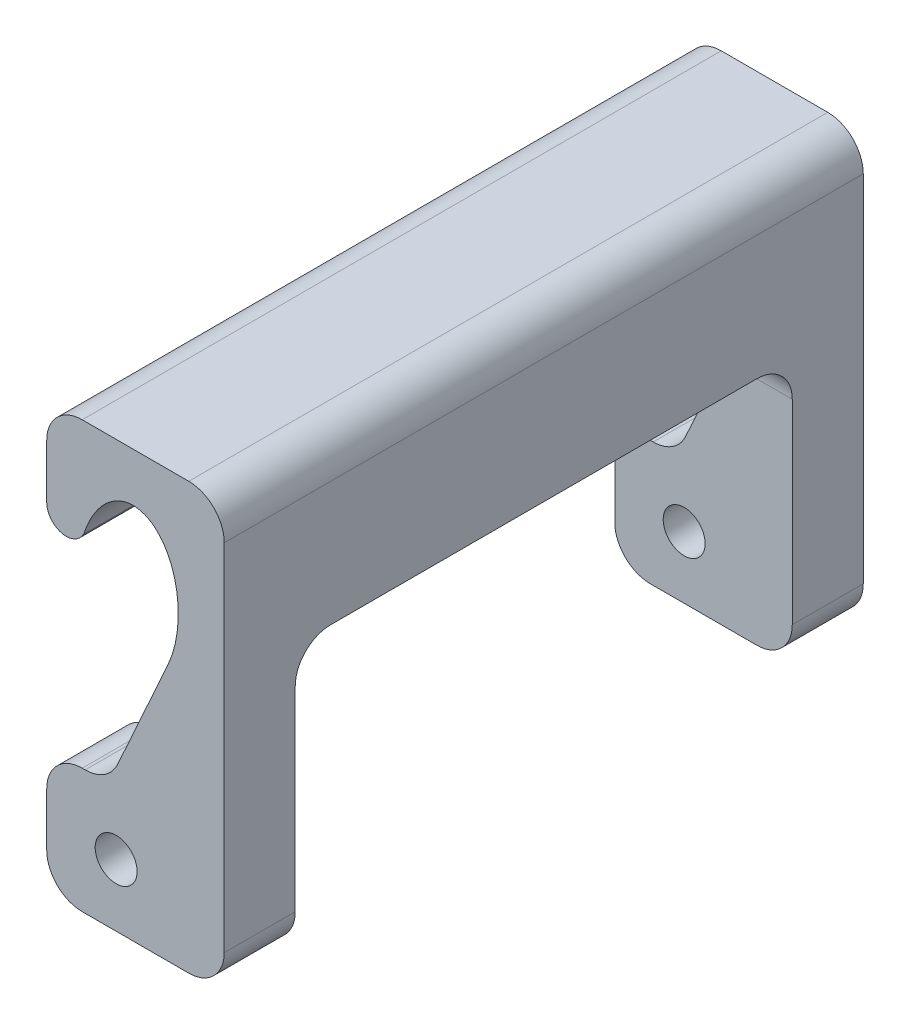
ISO-10303-21;
HEADER;
FILE_DESCRIPTION(('STEP AP214'),'2;1');
FILE_NAME('part.step','',(''),(''),'','','');
FILE_SCHEMA(('AUTOMOTIVE_DESIGN { 1 0 10303 214 1 1 1 1 }'));
ENDSEC;
DATA;
#1=APPLICATION_CONTEXT('core data for automotive mechanical design processes');
#2=APPLICATION_PROTOCOL_DEFINITION('international standard','automotive_design',2000,#1);
#3=PRODUCT_CONTEXT('',#1,'mechanical');
#4=PRODUCT('Part','Part','',(#3));
#5=PRODUCT_RELATED_PRODUCT_CATEGORY('part','',(#4));
#6=PRODUCT_DEFINITION_FORMATION('','',#4);
#7=PRODUCT_DEFINITION_CONTEXT('part definition',#1,'design');
#8=PRODUCT_DEFINITION('design','',#6,#7);
#9=PRODUCT_DEFINITION_SHAPE('','',#8);
#10=(LENGTH_UNIT() NAMED_UNIT(*) SI_UNIT(.MILLI.,.METRE.));
#11=(NAMED_UNIT(*) PLANE_ANGLE_UNIT() SI_UNIT($,.RADIAN.));
#12=(NAMED_UNIT(*) SI_UNIT($,.STERADIAN.) SOLID_ANGLE_UNIT());
#13=UNCERTAINTY_MEASURE_WITH_UNIT(LENGTH_MEASURE(1.E-05),#10,'distance_accuracy_value','');
#14=(GEOMETRIC_REPRESENTATION_CONTEXT(3) GLOBAL_UNCERTAINTY_ASSIGNED_CONTEXT((#13)) GLOBAL_UNIT_ASSIGNED_CONTEXT((#10,
#11,#12)) REPRESENTATION_CONTEXT('',''));
#15=CARTESIAN_POINT('',(0.,0.,0.));
#16=DIRECTION('',(0.,0.,1.));
#17=DIRECTION('',(1.,0.,0.));
#18=AXIS2_PLACEMENT_3D('',#15,#16,#17);
#19=CARTESIAN_POINT('',(0.311656887674147,-0.140809502418782,45.72));
#20=DIRECTION('',(0.911303427490063,-0.411735428454807,0.));
#21=DIRECTION('',(0.411735428454807,0.911303427490063,0.));
#22=AXIS2_PLACEMENT_3D('',#19,#20,#21);
#23=PLANE('',#22);
#24=CARTESIAN_POINT('',(7.83464865725413,16.51,38.1));
#25=DIRECTION('',(0.911303427490063,-0.411735428454807,0.));
#26=DIRECTION('',(0.411735428454807,0.911303427490063,0.));
#27=AXIS2_PLACEMENT_3D('',#24,#25,#26);
#28=ELLIPSE('',#27,2.78721655529788,2.54);
#29=CARTESIAN_POINT('',(8.67788432102674,18.3763527534216,39.8228834550821));
#30=VERTEX_POINT('',#29);
#31=CARTESIAN_POINT('',(7.83464865725413,16.51,40.64));
#32=VERTEX_POINT('',#31);
#33=EDGE_CURVE('E540',#30,#32,#28,.T.);
#34=ORIENTED_EDGE('',*,*,#33,.T.);
#35=DIRECTION('',(-0.411735428454807,-0.911303427490063,0.));
#36=VECTOR('',#35,1.);
#37=CARTESIAN_POINT('',(0.311656887674147,-0.140809502418782,40.64));
#38=LINE('',#37,#36);
#39=CARTESIAN_POINT('',(5.06695120259721,10.3841920117248,40.64));
#40=VERTEX_POINT('',#39);
#41=EDGE_CURVE('E421',#32,#40,#38,.T.);
#42=ORIENTED_EDGE('',*,*,#41,.T.);
#43=DIRECTION('',(0.,0.,-1.));
#44=VECTOR('',#43,1.);
#45=CARTESIAN_POINT('',(5.06695120259721,10.3841920117248,45.72));
#46=LINE('',#45,#44);
#47=CARTESIAN_POINT('',(5.06695120259721,10.3841920117248,45.72));
#48=VERTEX_POINT('',#47);
#49=EDGE_CURVE('E330',#48,#40,#46,.T.);
#50=ORIENTED_EDGE('',*,*,#49,.F.);
#51=DIRECTION('',(-0.411735428454807,-0.911303427490063,0.));
#52=VECTOR('',#51,1.);
#53=CARTESIAN_POINT('',(0.311656887674147,-0.140809502418782,45.72));
#54=LINE('',#53,#52);
#55=CARTESIAN_POINT('',(8.67788432102674,18.3763527534216,45.72));
#56=VERTEX_POINT('',#55);
#57=EDGE_CURVE('E640',#56,#48,#54,.T.);
#58=ORIENTED_EDGE('',*,*,#57,.F.);
#59=DIRECTION('',(0.,0.,-1.));
#60=VECTOR('',#59,1.);
#61=CARTESIAN_POINT('',(8.67788432102674,18.3763527534216,45.72));
#62=LINE('',#61,#60);
#63=EDGE_CURVE('E11',#56,#30,#62,.T.);
#64=ORIENTED_EDGE('',*,*,#63,.T.);
#65=EDGE_LOOP('',(#34,#42,#50,#58,#64));
#66=FACE_BOUND('',#65,.T.);
#67=ADVANCED_FACE('F41',(#66),#23,.F.);
#68=CARTESIAN_POINT('',(2.75224049677245,11.43,45.72));
#69=DIRECTION('',(0.,0.,-1.));
#70=DIRECTION('',(-1.,0.,0.));
#71=AXIS2_PLACEMENT_3D('',#68,#69,#70);
#72=CYLINDRICAL_SURFACE('',#71,2.54);
#73=ORIENTED_EDGE('',*,*,#49,.T.);
#74=CARTESIAN_POINT('',(2.75224049677245,11.43,40.64));
#75=DIRECTION('',(0.,0.,1.));
#76=DIRECTION('',(1.,0.,0.));
#77=AXIS2_PLACEMENT_3D('',#74,#75,#76);
#78=CIRCLE('',#77,2.54);
#79=CARTESIAN_POINT('',(2.75224049677245,8.89,40.64));
#80=VERTEX_POINT('',#79);
#81=EDGE_CURVE('E417',#40,#80,#78,.F.);
#82=ORIENTED_EDGE('',*,*,#81,.T.);
#83=DIRECTION('',(0.,0.,-1.));
#84=VECTOR('',#83,1.);
#85=CARTESIAN_POINT('',(2.75224049677245,8.89,45.72));
#86=LINE('',#85,#84);
#87=CARTESIAN_POINT('',(2.75224049677245,8.89,45.72));
#88=VERTEX_POINT('',#87);
#89=EDGE_CURVE('E325',#88,#80,#86,.T.);
#90=ORIENTED_EDGE('',*,*,#89,.F.);
#91=CARTESIAN_POINT('',(2.75224049677245,11.43,45.72));
#92=DIRECTION('',(0.,0.,1.));
#93=DIRECTION('',(1.,0.,0.));
#94=AXIS2_PLACEMENT_3D('',#91,#92,#93);
#95=CIRCLE('',#94,2.54);
#96=EDGE_CURVE('E642',#48,#88,#95,.F.);
#97=ORIENTED_EDGE('',*,*,#96,.F.);
#98=EDGE_LOOP('',(#73,#82,#90,#97));
#99=FACE_BOUND('',#98,.T.);
#100=ADVANCED_FACE('F525',(#99),#72,.F.);
#101=CARTESIAN_POINT('',(0.,8.89000000000002,45.72));
#102=DIRECTION('',(0.,-1.,0.));
#103=DIRECTION('',(1.,0.,0.));
#104=AXIS2_PLACEMENT_3D('',#101,#102,#103);
#105=PLANE('',#104);
#106=ORIENTED_EDGE('',*,*,#89,.T.);
#107=DIRECTION('',(-1.,0.,0.));
#108=VECTOR('',#107,1.);
#109=CARTESIAN_POINT('',(0.,8.89000000000002,40.64));
#110=LINE('',#109,#108);
#111=CARTESIAN_POINT('',(2.54,8.89,40.64));
#112=VERTEX_POINT('',#111);
#113=EDGE_CURVE('E413',#80,#112,#110,.T.);
#114=ORIENTED_EDGE('',*,*,#113,.T.);
#115=DIRECTION('',(0.,0.,-1.));
#116=VECTOR('',#115,1.);
#117=CARTESIAN_POINT('',(2.54,8.89,45.72));
#118=LINE('',#117,#116);
#119=CARTESIAN_POINT('',(2.54,8.89,45.72));
#120=VERTEX_POINT('',#119);
#121=EDGE_CURVE('E320',#120,#112,#118,.T.);
#122=ORIENTED_EDGE('',*,*,#121,.F.);
#123=DIRECTION('',(-1.,0.,0.));
#124=VECTOR('',#123,1.);
#125=CARTESIAN_POINT('',(0.,8.89000000000002,45.72));
#126=LINE('',#125,#124);
#127=EDGE_CURVE('E644',#88,#120,#126,.T.);
#128=ORIENTED_EDGE('',*,*,#127,.F.);
#129=EDGE_LOOP('',(#106,#114,#122,#128));
#130=FACE_BOUND('',#129,.T.);
#131=ADVANCED_FACE('F521',(#130),#105,.F.);
#132=CARTESIAN_POINT('',(2.54,6.35,45.72));
#133=DIRECTION('',(0.,0.,-1.));
#134=DIRECTION('',(-1.,0.,0.));
#135=AXIS2_PLACEMENT_3D('',#132,#133,#134);
#136=CYLINDRICAL_SURFACE('',#135,2.54);
#137=ORIENTED_EDGE('',*,*,#121,.T.);
#138=CARTESIAN_POINT('',(2.54,6.35,40.64));
#139=DIRECTION('',(0.,0.,1.));
#140=DIRECTION('',(1.,0.,0.));
#141=AXIS2_PLACEMENT_3D('',#138,#139,#140);
#142=CIRCLE('',#141,2.54);
#143=CARTESIAN_POINT('',(0.,6.35,40.64));
#144=VERTEX_POINT('',#143);
#145=EDGE_CURVE('E409',#112,#144,#142,.T.);
#146=ORIENTED_EDGE('',*,*,#145,.T.);
#147=DIRECTION('',(0.,0.,-1.));
#148=VECTOR('',#147,1.);
#149=CARTESIAN_POINT('',(0.,6.35,45.72));
#150=LINE('',#149,#148);
#151=CARTESIAN_POINT('',(0.,6.35,45.72));
#152=VERTEX_POINT('',#151);
#153=EDGE_CURVE('E315',#152,#144,#150,.T.);
#154=ORIENTED_EDGE('',*,*,#153,.F.);
#155=CARTESIAN_POINT('',(2.54,6.35,45.72));
#156=DIRECTION('',(0.,0.,1.));
#157=DIRECTION('',(1.,0.,0.));
#158=AXIS2_PLACEMENT_3D('',#155,#156,#157);
#159=CIRCLE('',#158,2.54);
#160=EDGE_CURVE('E649',#120,#152,#159,.T.);
#161=ORIENTED_EDGE('',*,*,#160,.F.);
#162=EDGE_LOOP('',(#137,#146,#154,#161));
#163=FACE_BOUND('',#162,.T.);
#164=ADVANCED_FACE('F516',(#163),#136,.T.);
#165=CARTESIAN_POINT('',(0.,0.,45.72));
#166=DIRECTION('',(-1.,0.,0.));
#167=DIRECTION('',(0.,0.,1.));
#168=AXIS2_PLACEMENT_3D('',#165,#166,#167);
#169=PLANE('',#168);
#170=DIRECTION('',(0.,1.,0.));
#171=VECTOR('',#170,1.);
#172=CARTESIAN_POINT('',(0.,0.,40.64));
#173=LINE('',#172,#171);
#174=CARTESIAN_POINT('',(0.,2.54000000000002,40.64));
#175=VERTEX_POINT('',#174);
#176=EDGE_CURVE('E405',#175,#144,#173,.T.);
#177=ORIENTED_EDGE('',*,*,#176,.F.);
#178=DIRECTION('',(0.,0.,-1.));
#179=VECTOR('',#178,1.);
#180=CARTESIAN_POINT('',(0.,2.54000000000002,45.72));
#181=LINE('',#180,#179);
#182=CARTESIAN_POINT('',(0.,2.54000000000002,45.72));
#183=VERTEX_POINT('',#182);
#184=EDGE_CURVE('E310',#183,#175,#181,.T.);
#185=ORIENTED_EDGE('',*,*,#184,.F.);
#186=DIRECTION('',(0.,1.,0.));
#187=VECTOR('',#186,1.);
#188=CARTESIAN_POINT('',(0.,0.,45.72));
#189=LINE('',#188,#187);
#190=EDGE_CURVE('E652',#183,#152,#189,.T.);
#191=ORIENTED_EDGE('',*,*,#190,.T.);
#192=ORIENTED_EDGE('',*,*,#153,.T.);
#193=EDGE_LOOP('',(#177,#185,#191,#192));
#194=FACE_BOUND('',#193,.T.);
#195=ADVANCED_FACE('F511',(#194),#169,.T.);
#196=CARTESIAN_POINT('',(2.54,2.54,45.72));
#197=DIRECTION('',(0.,0.,-1.));
#198=DIRECTION('',(-1.,0.,0.));
#199=AXIS2_PLACEMENT_3D('',#196,#197,#198);
#200=CYLINDRICAL_SURFACE('',#199,2.54);
#201=CARTESIAN_POINT('',(2.54,2.54,40.64));
#202=DIRECTION('',(0.,0.,1.));
#203=DIRECTION('',(1.,0.,0.));
#204=AXIS2_PLACEMENT_3D('',#201,#202,#203);
#205=CIRCLE('',#204,2.54);
#206=CARTESIAN_POINT('',(2.54000000000002,0.,40.64));
#207=VERTEX_POINT('',#206);
#208=EDGE_CURVE('E401',#207,#175,#205,.F.);
#209=ORIENTED_EDGE('',*,*,#208,.F.);
#210=DIRECTION('',(0.,0.,-1.));
#211=VECTOR('',#210,1.);
#212=CARTESIAN_POINT('',(2.54000000000002,0.,45.72));
#213=LINE('',#212,#211);
#214=CARTESIAN_POINT('',(2.54000000000002,0.,45.72));
#215=VERTEX_POINT('',#214);
#216=EDGE_CURVE('E305',#215,#207,#213,.T.);
#217=ORIENTED_EDGE('',*,*,#216,.F.);
#218=CARTESIAN_POINT('',(2.54,2.54,45.72));
#219=DIRECTION('',(0.,0.,1.));
#220=DIRECTION('',(1.,0.,0.));
#221=AXIS2_PLACEMENT_3D('',#218,#219,#220);
#222=CIRCLE('',#221,2.54);
#223=EDGE_CURVE('E656',#215,#183,#222,.F.);
#224=ORIENTED_EDGE('',*,*,#223,.T.);
#225=ORIENTED_EDGE('',*,*,#184,.T.);
#226=EDGE_LOOP('',(#209,#217,#224,#225));
#227=FACE_BOUND('',#226,.T.);
#228=ADVANCED_FACE('F506',(#227),#200,.T.);
#229=CARTESIAN_POINT('',(0.,0.,45.72));
#230=DIRECTION('',(0.,1.,0.));
#231=DIRECTION('',(0.,0.,1.));
#232=AXIS2_PLACEMENT_3D('',#229,#230,#231);
#233=PLANE('',#232);
#234=ORIENTED_EDGE('',*,*,#216,.T.);
#235=DIRECTION('',(1.,0.,0.));
#236=VECTOR('',#235,1.);
#237=CARTESIAN_POINT('',(-12.7,0.,40.64));
#238=LINE('',#237,#236);
#239=CARTESIAN_POINT('',(10.16,0.,40.64));
#240=VERTEX_POINT('',#239);
#241=EDGE_CURVE('E370',#207,#240,#238,.T.);
#242=ORIENTED_EDGE('',*,*,#241,.T.);
#243=DIRECTION('',(0.,0.,-1.));
#244=VECTOR('',#243,1.);
#245=CARTESIAN_POINT('',(10.16,0.,45.72));
#246=LINE('',#245,#244);
#247=CARTESIAN_POINT('',(10.16,0.,45.72));
#248=VERTEX_POINT('',#247);
#249=EDGE_CURVE('E300',#248,#240,#246,.T.);
#250=ORIENTED_EDGE('',*,*,#249,.F.);
#251=DIRECTION('',(1.,0.,0.));
#252=VECTOR('',#251,1.);
#253=CARTESIAN_POINT('',(0.,0.,45.72));
#254=LINE('',#253,#252);
#255=EDGE_CURVE('E632',#215,#248,#254,.T.);
#256=ORIENTED_EDGE('',*,*,#255,.F.);
#257=EDGE_LOOP('',(#234,#242,#250,#256));
#258=FACE_BOUND('',#257,.T.);
#259=ADVANCED_FACE('F501',(#258),#233,.F.);
#260=CARTESIAN_POINT('',(10.16,2.54,45.72));
#261=DIRECTION('',(0.,0.,-1.));
#262=DIRECTION('',(-1.,0.,0.));
#263=AXIS2_PLACEMENT_3D('',#260,#261,#262);
#264=CYLINDRICAL_SURFACE('',#263,2.54);
#265=ORIENTED_EDGE('',*,*,#249,.T.);
#266=CARTESIAN_POINT('',(10.16,2.54,40.64));
#267=DIRECTION('',(0.,0.,1.));
#268=DIRECTION('',(1.,0.,0.));
#269=AXIS2_PLACEMENT_3D('',#266,#267,#268);
#270=CIRCLE('',#269,2.54);
#271=CARTESIAN_POINT('',(12.7,2.54000000000002,40.64));
#272=VERTEX_POINT('',#271);
#273=EDGE_CURVE('E397',#240,#272,#270,.T.);
#274=ORIENTED_EDGE('',*,*,#273,.T.);
#275=DIRECTION('',(0.,0.,-1.));
#276=VECTOR('',#275,1.);
#277=CARTESIAN_POINT('',(12.7,2.54000000000002,45.72));
#278=LINE('',#277,#276);
#279=CARTESIAN_POINT('',(12.7,2.54000000000002,45.72));
#280=VERTEX_POINT('',#279);
#281=EDGE_CURVE('E295',#280,#272,#278,.T.);
#282=ORIENTED_EDGE('',*,*,#281,.F.);
#283=CARTESIAN_POINT('',(10.16,2.54,45.72));
#284=DIRECTION('',(0.,0.,1.));
#285=DIRECTION('',(1.,0.,0.));
#286=AXIS2_PLACEMENT_3D('',#283,#284,#285);
#287=CIRCLE('',#286,2.54);
#288=EDGE_CURVE('E627',#248,#280,#287,.T.);
#289=ORIENTED_EDGE('',*,*,#288,.F.);
#290=EDGE_LOOP('',(#265,#274,#282,#289));
#291=FACE_BOUND('',#290,.T.);
#292=ADVANCED_FACE('F496',(#291),#264,.T.);
#293=CARTESIAN_POINT('',(4.96545990115376,4.445,45.72));
#294=DIRECTION('',(0.,0.,-1.));
#295=DIRECTION('',(-1.,0.,0.));
#296=AXIS2_PLACEMENT_3D('',#293,#294,#295);
#297=CYLINDRICAL_SURFACE('',#296,1.5);
#298=CARTESIAN_POINT('',(4.96545990115376,4.445,40.64));
#299=DIRECTION('',(0.,0.,1.));
#300=DIRECTION('',(1.,0.,0.));
#301=AXIS2_PLACEMENT_3D('',#298,#299,#300);
#302=CIRCLE('',#301,1.5);
#303=CARTESIAN_POINT('',(6.46545990115376,4.445,40.64));
#304=VERTEX_POINT('',#303);
#305=EDGE_CURVE('E47',#304,#304,#302,.T.);
#306=ORIENTED_EDGE('',*,*,#305,.F.);
#307=EDGE_LOOP('',(#306));
#308=FACE_BOUND('',#307,.T.);
#309=CARTESIAN_POINT('',(4.96545990115376,4.445,45.72));
#310=DIRECTION('',(0.,0.,1.));
#311=DIRECTION('',(1.,0.,0.));
#312=AXIS2_PLACEMENT_3D('',#309,#310,#311);
#313=CIRCLE('',#312,1.5);
#314=CARTESIAN_POINT('',(6.46545990115376,4.445,45.72));
#315=VERTEX_POINT('',#314);
#316=EDGE_CURVE('E209',#315,#315,#313,.T.);
#317=ORIENTED_EDGE('',*,*,#316,.T.);
#318=EDGE_LOOP('',(#317));
#319=FACE_BOUND('',#318,.T.);
#320=ADVANCED_FACE('F467',(#308,#319),#297,.F.);
#321=CARTESIAN_POINT('',(5.83074598447333,21.3467680639256,45.72));
#322=DIRECTION('',(0.,0.,1.));
#323=DIRECTION('',(0.101591226665085,0.994826227370732,0.));
#324=AXIS2_PLACEMENT_3D('',#321,#322,#323);
#325=ELLIPSE('',#324,5.66584187375599,3.551885910818);
#326=DIRECTION('',(0.,0.,-1.));
#327=VECTOR('',#326,1.);
#328=SURFACE_OF_LINEAR_EXTRUSION('',#325,#327);
#329=CARTESIAN_POINT('',(8.67788432102674,18.3763527534216,39.8228834550821));
#330=CARTESIAN_POINT('',(8.69787296779544,18.4205974052909,39.7749710909758));
#331=CARTESIAN_POINT('',(8.71660807007314,18.463240862749,39.7250570360412));
#332=CARTESIAN_POINT('',(8.75165650747225,18.5449039928031,39.6215444018873));
#333=CARTESIAN_POINT('',(8.76796967726581,18.5839234179446,39.5679455715));
#334=CARTESIAN_POINT('',(8.79827018255615,18.6579434624629,39.4573402636873));
#335=CARTESIAN_POINT('',(8.81225546032954,18.6929405179274,39.4003308313526));
#336=CARTESIAN_POINT('',(8.8379702182126,18.7585028978315,39.283357806939));
#337=CARTESIAN_POINT('',(8.84969988024391,18.7890685796248,39.2233944535924));
#338=CARTESIAN_POINT('',(8.88166811372579,18.8736932034335,39.0395356836398));
#339=CARTESIAN_POINT('',(8.89867697342782,18.92065716862,38.911705118039));
#340=CARTESIAN_POINT('',(8.92464353398097,18.9935277998132,38.649674176556));
#341=CARTESIAN_POINT('',(8.9336184372242,19.0194794461761,38.5154880615331));
#342=CARTESIAN_POINT('',(8.94057625132413,19.0396707390198,38.3335983534008));
#343=CARTESIAN_POINT('',(8.94190736417489,19.0435445719229,38.286943915309));
#344=CARTESIAN_POINT('',(8.94367882669138,19.0487066976717,38.1935325979844));
#345=CARTESIAN_POINT('',(8.94412026460067,19.0499981492513,38.1467759140223));
#346=CARTESIAN_POINT('',(8.94412128394432,19.05,38.1));
#347=B_SPLINE_CURVE_WITH_KNOTS('',3,(#329,#330,#331,#332,#333,#334,#335,#336,#337,#338,#339,
#340,#341,#342,#343,#344,#345,#346),.UNSPECIFIED.,.F.,.F.,(4,2,2,2,2,2,2,2,4),(0.,
0.204573196570767,0.409160351463358,0.613927400229825,0.818677927035218,1.22830162114212,
1.63704611203805,1.77748741889201,1.91775683450172),.UNSPECIFIED.);
#348=CARTESIAN_POINT('',(8.94412128394432,19.05,38.1));
#349=VERTEX_POINT('',#348);
#350=EDGE_CURVE('E218',#30,#349,#347,.T.);
#351=ORIENTED_EDGE('',*,*,#350,.F.);
#352=ORIENTED_EDGE('',*,*,#63,.F.);
#353=CARTESIAN_POINT('',(2.66198422272704,23.4759143936431,45.72));
#354=VERTEX_POINT('',#353);
#355=EDGE_CURVE('E278',#56,#354,#325,.T.);
#356=ORIENTED_EDGE('',*,*,#355,.T.);
#357=DIRECTION('',(0.,0.,-1.));
#358=VECTOR('',#357,1.);
#359=CARTESIAN_POINT('',(2.66198422272704,23.4759143936431,45.72));
#360=LINE('',#359,#358);
#361=CARTESIAN_POINT('',(2.66198422272704,23.4759143936431,0.));
#362=VERTEX_POINT('',#361);
#363=EDGE_CURVE('E127',#354,#362,#360,.T.);
#364=ORIENTED_EDGE('',*,*,#363,.T.);
#365=CARTESIAN_POINT('',(5.83074598447333,21.3467680639256,0.));
#366=DIRECTION('',(0.,0.,1.));
#367=DIRECTION('',(0.101591226665085,0.994826227370732,0.));
#368=AXIS2_PLACEMENT_3D('',#365,#366,#367);
#369=ELLIPSE('',#368,5.66584187375599,3.551885910818);
#370=CARTESIAN_POINT('',(8.67788432102674,18.3763527534216,0.));
#371=VERTEX_POINT('',#370);
#372=EDGE_CURVE('E213',#371,#362,#369,.T.);
#373=ORIENTED_EDGE('',*,*,#372,.F.);
#374=CARTESIAN_POINT('',(8.67788432102674,18.3763527534216,5.89711654491789));
#375=VERTEX_POINT('',#374);
#376=EDGE_CURVE('E53',#375,#371,#62,.T.);
#377=ORIENTED_EDGE('',*,*,#376,.F.);
#378=CARTESIAN_POINT('',(8.94412128394432,19.05,7.62));
#379=CARTESIAN_POINT('',(8.94411744622764,19.0500084350514,7.55235527562383));
#380=CARTESIAN_POINT('',(8.94319555233235,19.0472978842794,7.48471349567374));
#381=CARTESIAN_POINT('',(8.93948846745423,19.0365023035919,7.34991302489279));
#382=CARTESIAN_POINT('',(8.93670331979508,19.0284173986388,7.28275432286627));
#383=CARTESIAN_POINT('',(8.92924276555118,19.0069372315579,7.1493979604874));
#384=CARTESIAN_POINT('',(8.92456747072776,18.9935422834051,7.08320024355326));
#385=CARTESIAN_POINT('',(8.91327785177726,18.9615837371972,6.95225371738255));
#386=CARTESIAN_POINT('',(8.90666361770245,18.9430203791862,6.8875048410062));
#387=CARTESIAN_POINT('',(8.88380311368909,18.8797905657873,6.69602714068755));
#388=CARTESIAN_POINT('',(8.86453814630989,18.827581625617,6.57205042730353));
#389=CARTESIAN_POINT('',(8.81733539497483,18.7052247468066,6.3353590148333));
#390=CARTESIAN_POINT('',(8.78941243915953,18.635107514801,6.22262549304173));
#391=CARTESIAN_POINT('',(8.74494001615509,18.5292234584191,6.07836307123691));
#392=CARTESIAN_POINT('',(8.73241609526259,18.499890983795,6.04069657955672));
#393=CARTESIAN_POINT('',(8.70610735365129,18.4394347827262,5.96738672067184));
#394=CARTESIAN_POINT('',(8.6923243396361,18.4083136459529,5.93174056992611));
#395=CARTESIAN_POINT('',(8.67788432102674,18.3763527534216,5.89711654491788));
#396=B_SPLINE_CURVE_WITH_KNOTS('',3,(#378,#379,#380,#381,#382,#383,#384,#385,#386,#387,#388,
#389,#390,#391,#392,#393,#394,#395),.UNSPECIFIED.,.F.,.F.,(4,2,2,2,2,2,2,2,4),(0.,
0.202868346650419,0.405731976446307,0.608583613000098,0.811425829786608,1.21705972458935,
1.62200271060843,1.77000070361261,1.91778957005461),.UNSPECIFIED.);
#397=CARTESIAN_POINT('',(8.94412128394432,19.05,7.62));
#398=VERTEX_POINT('',#397);
#399=EDGE_CURVE('E429',#398,#375,#396,.T.);
#400=ORIENTED_EDGE('',*,*,#399,.F.);
#401=DIRECTION('',(0.,0.,-1.));
#402=VECTOR('',#401,1.);
#403=CARTESIAN_POINT('',(8.94412128394432,19.05,45.72));
#404=LINE('',#403,#402);
#405=EDGE_CURVE('E438',#349,#398,#404,.T.);
#406=ORIENTED_EDGE('',*,*,#405,.F.);
#407=EDGE_LOOP('',(#351,#352,#356,#364,#373,#377,#400,#406));
#408=FACE_BOUND('',#407,.T.);
#409=ADVANCED_FACE('F43',(#408),#328,.T.);
#410=DIRECTION('',(0.411735428454807,0.911303427490063,0.));
#411=VECTOR('',#410,1.);
#412=CARTESIAN_POINT('',(0.311656887674145,-0.140809502418786,5.08));
#413=LINE('',#412,#411);
#414=CARTESIAN_POINT('',(5.06695120259721,10.3841920117248,5.08));
#415=VERTEX_POINT('',#414);
#416=CARTESIAN_POINT('',(7.83464865725413,16.51,5.08));
#417=VERTEX_POINT('',#416);
#418=EDGE_CURVE('E393',#415,#417,#413,.T.);
#419=ORIENTED_EDGE('',*,*,#418,.T.);
#420=CARTESIAN_POINT('',(7.83464865725413,16.51,7.62));
#421=DIRECTION('',(0.911303427490063,-0.411735428454807,0.));
#422=DIRECTION('',(0.411735428454807,0.911303427490063,0.));
#423=AXIS2_PLACEMENT_3D('',#420,#421,#422);
#424=ELLIPSE('',#423,2.78721655529788,2.54);
#425=EDGE_CURVE('E425',#417,#375,#424,.T.);
#426=ORIENTED_EDGE('',*,*,#425,.T.);
#427=ORIENTED_EDGE('',*,*,#376,.T.);
#428=DIRECTION('',(-0.411735428454807,-0.911303427490063,0.));
#429=VECTOR('',#428,1.);
#430=CARTESIAN_POINT('',(0.311656887674147,-0.140809502418782,0.));
#431=LINE('',#430,#429);
#432=CARTESIAN_POINT('',(5.06695120259721,10.3841920117248,0.));
#433=VERTEX_POINT('',#432);
#434=EDGE_CURVE('E217',#371,#433,#431,.T.);
#435=ORIENTED_EDGE('',*,*,#434,.T.);
#436=EDGE_CURVE('E329',#415,#433,#46,.T.);
#437=ORIENTED_EDGE('',*,*,#436,.F.);
#438=EDGE_LOOP('',(#419,#426,#427,#435,#437));
#439=FACE_BOUND('',#438,.T.);
#440=ADVANCED_FACE('F523',(#439),#23,.F.);
#441=CARTESIAN_POINT('',(2.75224049677245,8.89,5.08));
#442=VERTEX_POINT('',#441);
#443=CARTESIAN_POINT('',(2.75224049677245,8.89,0.));
#444=VERTEX_POINT('',#443);
#445=EDGE_CURVE('E324',#442,#444,#86,.T.);
#446=ORIENTED_EDGE('',*,*,#445,.F.);
#447=CARTESIAN_POINT('',(2.75224049677245,11.43,5.08));
#448=DIRECTION('',(0.,0.,-1.));
#449=DIRECTION('',(0.,1.,0.));
#450=AXIS2_PLACEMENT_3D('',#447,#448,#449);
#451=CIRCLE('',#450,2.54);
#452=EDGE_CURVE('E389',#442,#415,#451,.F.);
#453=ORIENTED_EDGE('',*,*,#452,.T.);
#454=ORIENTED_EDGE('',*,*,#436,.T.);
#455=CARTESIAN_POINT('',(2.75224049677245,11.43,0.));
#456=DIRECTION('',(0.,0.,1.));
#457=DIRECTION('',(1.,0.,0.));
#458=AXIS2_PLACEMENT_3D('',#455,#456,#457);
#459=CIRCLE('',#458,2.54);
#460=EDGE_CURVE('E222',#433,#444,#459,.F.);
#461=ORIENTED_EDGE('',*,*,#460,.T.);
#462=EDGE_LOOP('',(#446,#453,#454,#461));
#463=FACE_BOUND('',#462,.T.);
#464=ADVANCED_FACE('F519',(#463),#72,.F.);
#465=CARTESIAN_POINT('',(2.54,8.89,5.08));
#466=VERTEX_POINT('',#465);
#467=CARTESIAN_POINT('',(2.54,8.89,0.));
#468=VERTEX_POINT('',#467);
#469=EDGE_CURVE('E319',#466,#468,#118,.T.);
#470=ORIENTED_EDGE('',*,*,#469,.F.);
#471=DIRECTION('',(1.,0.,0.));
#472=VECTOR('',#471,1.);
#473=CARTESIAN_POINT('',(0.,8.89000000000002,5.08));
#474=LINE('',#473,#472);
#475=EDGE_CURVE('E385',#466,#442,#474,.T.);
#476=ORIENTED_EDGE('',*,*,#475,.T.);
#477=ORIENTED_EDGE('',*,*,#445,.T.);
#478=DIRECTION('',(-1.,0.,0.));
#479=VECTOR('',#478,1.);
#480=CARTESIAN_POINT('',(0.,8.89000000000002,0.));
#481=LINE('',#480,#479);
#482=EDGE_CURVE('E226',#444,#468,#481,.T.);
#483=ORIENTED_EDGE('',*,*,#482,.T.);
#484=EDGE_LOOP('',(#470,#476,#477,#483));
#485=FACE_BOUND('',#484,.T.);
#486=ADVANCED_FACE('F514',(#485),#105,.F.);
#487=CARTESIAN_POINT('',(0.,6.35,5.08));
#488=VERTEX_POINT('',#487);
#489=CARTESIAN_POINT('',(0.,6.35,0.));
#490=VERTEX_POINT('',#489);
#491=EDGE_CURVE('E314',#488,#490,#150,.T.);
#492=ORIENTED_EDGE('',*,*,#491,.F.);
#493=CARTESIAN_POINT('',(2.54,6.35,5.08));
#494=DIRECTION('',(0.,0.,-1.));
#495=DIRECTION('',(0.,1.,0.));
#496=AXIS2_PLACEMENT_3D('',#493,#494,#495);
#497=CIRCLE('',#496,2.54);
#498=EDGE_CURVE('E381',#488,#466,#497,.T.);
#499=ORIENTED_EDGE('',*,*,#498,.T.);
#500=ORIENTED_EDGE('',*,*,#469,.T.);
#501=CARTESIAN_POINT('',(2.54,6.35,0.));
#502=DIRECTION('',(0.,0.,1.));
#503=DIRECTION('',(1.,0.,0.));
#504=AXIS2_PLACEMENT_3D('',#501,#502,#503);
#505=CIRCLE('',#504,2.54);
#506=EDGE_CURVE('E230',#468,#490,#505,.T.);
#507=ORIENTED_EDGE('',*,*,#506,.T.);
#508=EDGE_LOOP('',(#492,#499,#500,#507));
#509=FACE_BOUND('',#508,.T.);
#510=ADVANCED_FACE('F509',(#509),#136,.T.);
#511=DIRECTION('',(0.,-1.,0.));
#512=VECTOR('',#511,1.);
#513=CARTESIAN_POINT('',(0.,0.,5.08));
#514=LINE('',#513,#512);
#515=CARTESIAN_POINT('',(0.,2.54000000000002,5.08));
#516=VERTEX_POINT('',#515);
#517=EDGE_CURVE('E377',#488,#516,#514,.T.);
#518=ORIENTED_EDGE('',*,*,#517,.F.);
#519=ORIENTED_EDGE('',*,*,#491,.T.);
#520=DIRECTION('',(0.,1.,0.));
#521=VECTOR('',#520,1.);
#522=CARTESIAN_POINT('',(0.,0.,0.));
#523=LINE('',#522,#521);
#524=CARTESIAN_POINT('',(0.,2.54000000000002,0.));
#525=VERTEX_POINT('',#524);
#526=EDGE_CURVE('E234',#525,#490,#523,.T.);
#527=ORIENTED_EDGE('',*,*,#526,.F.);
#528=EDGE_CURVE('E309',#516,#525,#181,.T.);
#529=ORIENTED_EDGE('',*,*,#528,.F.);
#530=EDGE_LOOP('',(#518,#519,#527,#529));
#531=FACE_BOUND('',#530,.T.);
#532=ADVANCED_FACE('F504',(#531),#169,.T.);
#533=CARTESIAN_POINT('',(2.54,2.54,5.08));
#534=DIRECTION('',(0.,0.,-1.));
#535=DIRECTION('',(0.,1.,0.));
#536=AXIS2_PLACEMENT_3D('',#533,#534,#535);
#537=CIRCLE('',#536,2.54);
#538=CARTESIAN_POINT('',(2.54000000000002,0.,5.08));
#539=VERTEX_POINT('',#538);
#540=EDGE_CURVE('E341',#516,#539,#537,.F.);
#541=ORIENTED_EDGE('',*,*,#540,.F.);
#542=ORIENTED_EDGE('',*,*,#528,.T.);
#543=CARTESIAN_POINT('',(2.54,2.54,0.));
#544=DIRECTION('',(0.,0.,1.));
#545=DIRECTION('',(1.,0.,0.));
#546=AXIS2_PLACEMENT_3D('',#543,#544,#545);
#547=CIRCLE('',#546,2.54);
#548=CARTESIAN_POINT('',(2.54000000000002,0.,0.));
#549=VERTEX_POINT('',#548);
#550=EDGE_CURVE('E238',#549,#525,#547,.F.);
#551=ORIENTED_EDGE('',*,*,#550,.F.);
#552=EDGE_CURVE('E304',#539,#549,#213,.T.);
#553=ORIENTED_EDGE('',*,*,#552,.F.);
#554=EDGE_LOOP('',(#541,#542,#551,#553));
#555=FACE_BOUND('',#554,.T.);
#556=ADVANCED_FACE('F499',(#555),#200,.T.);
#557=CARTESIAN_POINT('',(10.16,0.,5.08));
#558=VERTEX_POINT('',#557);
#559=CARTESIAN_POINT('',(10.16,0.,0.));
#560=VERTEX_POINT('',#559);
#561=EDGE_CURVE('E299',#558,#560,#246,.T.);
#562=ORIENTED_EDGE('',*,*,#561,.F.);
#563=DIRECTION('',(1.,0.,0.));
#564=VECTOR('',#563,1.);
#565=CARTESIAN_POINT('',(-12.7,0.,5.08));
#566=LINE('',#565,#564);
#567=EDGE_CURVE('E367',#539,#558,#566,.T.);
#568=ORIENTED_EDGE('',*,*,#567,.F.);
#569=ORIENTED_EDGE('',*,*,#552,.T.);
#570=DIRECTION('',(1.,0.,0.));
#571=VECTOR('',#570,1.);
#572=CARTESIAN_POINT('',(0.,0.,0.));
#573=LINE('',#572,#571);
#574=EDGE_CURVE('E242',#549,#560,#573,.T.);
#575=ORIENTED_EDGE('',*,*,#574,.T.);
#576=EDGE_LOOP('',(#562,#568,#569,#575));
#577=FACE_BOUND('',#576,.T.);
#578=ADVANCED_FACE('F494',(#577),#233,.F.);
#579=CARTESIAN_POINT('',(12.7,2.54000000000002,5.08));
#580=VERTEX_POINT('',#579);
#581=CARTESIAN_POINT('',(12.7,2.54000000000002,0.));
#582=VERTEX_POINT('',#581);
#583=EDGE_CURVE('E294',#580,#582,#278,.T.);
#584=ORIENTED_EDGE('',*,*,#583,.F.);
#585=CARTESIAN_POINT('',(10.16,2.54,5.08));
#586=DIRECTION('',(0.,0.,-1.));
#587=DIRECTION('',(0.,1.,0.));
#588=AXIS2_PLACEMENT_3D('',#585,#586,#587);
#589=CIRCLE('',#588,2.54);
#590=EDGE_CURVE('E61',#580,#558,#589,.T.);
#591=ORIENTED_EDGE('',*,*,#590,.T.);
#592=ORIENTED_EDGE('',*,*,#561,.T.);
#593=CARTESIAN_POINT('',(10.16,2.54,0.));
#594=DIRECTION('',(0.,0.,1.));
#595=DIRECTION('',(1.,0.,0.));
#596=AXIS2_PLACEMENT_3D('',#593,#594,#595);
#597=CIRCLE('',#596,2.54);
#598=EDGE_CURVE('E246',#560,#582,#597,.T.);
#599=ORIENTED_EDGE('',*,*,#598,.T.);
#600=EDGE_LOOP('',(#584,#591,#592,#599));
#601=FACE_BOUND('',#600,.T.);
#602=ADVANCED_FACE('F490',(#601),#264,.T.);
#603=CARTESIAN_POINT('',(12.7,0.,45.72));
#604=DIRECTION('',(-1.,0.,0.));
#605=DIRECTION('',(0.,0.,1.));
#606=AXIS2_PLACEMENT_3D('',#603,#604,#605);
#607=PLANE('',#606);
#608=ORIENTED_EDGE('',*,*,#281,.T.);
#609=DIRECTION('',(0.,-1.,0.));
#610=VECTOR('',#609,1.);
#611=CARTESIAN_POINT('',(12.7,0.,40.64));
#612=LINE('',#611,#610);
#613=CARTESIAN_POINT('',(12.7,16.51,40.64));
#614=VERTEX_POINT('',#613);
#615=EDGE_CURVE('E672',#614,#272,#612,.T.);
#616=ORIENTED_EDGE('',*,*,#615,.F.);
#617=CARTESIAN_POINT('',(12.7,16.51,38.1));
#618=DIRECTION('',(1.,0.,0.));
#619=DIRECTION('',(0.,0.,1.));
#620=AXIS2_PLACEMENT_3D('',#617,#618,#619);
#621=CIRCLE('',#620,2.54);
#622=CARTESIAN_POINT('',(12.7,19.05,38.1));
#623=VERTEX_POINT('',#622);
#624=EDGE_CURVE('E357',#623,#614,#621,.T.);
#625=ORIENTED_EDGE('',*,*,#624,.F.);
#626=DIRECTION('',(0.,0.,1.));
#627=VECTOR('',#626,1.);
#628=CARTESIAN_POINT('',(12.7,19.05,38.1));
#629=LINE('',#628,#627);
#630=CARTESIAN_POINT('',(12.7,19.05,7.62));
#631=VERTEX_POINT('',#630);
#632=EDGE_CURVE('E574',#631,#623,#629,.T.);
#633=ORIENTED_EDGE('',*,*,#632,.F.);
#634=CARTESIAN_POINT('',(12.7,16.51,7.62));
#635=DIRECTION('',(1.,0.,0.));
#636=DIRECTION('',(0.,0.,1.));
#637=AXIS2_PLACEMENT_3D('',#634,#635,#636);
#638=CIRCLE('',#637,2.54);
#639=CARTESIAN_POINT('',(12.7,16.51,5.08));
#640=VERTEX_POINT('',#639);
#641=EDGE_CURVE('E909',#640,#631,#638,.T.);
#642=ORIENTED_EDGE('',*,*,#641,.F.);
#643=DIRECTION('',(0.,1.,0.));
#644=VECTOR('',#643,1.);
#645=CARTESIAN_POINT('',(12.7,0.,5.08));
#646=LINE('',#645,#644);
#647=EDGE_CURVE('E612',#580,#640,#646,.T.);
#648=ORIENTED_EDGE('',*,*,#647,.F.);
#649=ORIENTED_EDGE('',*,*,#583,.T.);
#650=DIRECTION('',(0.,1.,0.));
#651=VECTOR('',#650,1.);
#652=CARTESIAN_POINT('',(12.7,0.,0.));
#653=LINE('',#652,#651);
#654=CARTESIAN_POINT('',(12.7,27.94,0.));
#655=VERTEX_POINT('',#654);
#656=EDGE_CURVE('E250',#582,#655,#653,.T.);
#657=ORIENTED_EDGE('',*,*,#656,.T.);
#658=DIRECTION('',(0.,0.,-1.));
#659=VECTOR('',#658,1.);
#660=CARTESIAN_POINT('',(12.7,27.94,45.72));
#661=LINE('',#660,#659);
#662=CARTESIAN_POINT('',(12.7,27.94,45.72));
#663=VERTEX_POINT('',#662);
#664=EDGE_CURVE('E291',#663,#655,#661,.T.);
#665=ORIENTED_EDGE('',*,*,#664,.F.);
#666=DIRECTION('',(0.,1.,0.));
#667=VECTOR('',#666,1.);
#668=CARTESIAN_POINT('',(12.7,0.,45.72));
#669=LINE('',#668,#667);
#670=EDGE_CURVE('E623',#280,#663,#669,.T.);
#671=ORIENTED_EDGE('',*,*,#670,.F.);
#672=EDGE_LOOP('',(#608,#616,#625,#633,#642,#648,#649,#657,#665,#671));
#673=FACE_BOUND('',#672,.T.);
#674=ADVANCED_FACE('F486',(#673),#607,.F.);
#675=CARTESIAN_POINT('',(10.16,27.94,45.72));
#676=DIRECTION('',(0.,0.,-1.));
#677=DIRECTION('',(-1.,0.,0.));
#678=AXIS2_PLACEMENT_3D('',#675,#676,#677);
#679=CYLINDRICAL_SURFACE('',#678,2.54);
#680=CARTESIAN_POINT('',(10.16,27.94,0.));
#681=DIRECTION('',(0.,0.,1.));
#682=DIRECTION('',(1.,0.,0.));
#683=AXIS2_PLACEMENT_3D('',#680,#681,#682);
#684=CIRCLE('',#683,2.54);
#685=CARTESIAN_POINT('',(10.16,30.48,0.));
#686=VERTEX_POINT('',#685);
#687=EDGE_CURVE('E254',#686,#655,#684,.F.);
#688=ORIENTED_EDGE('',*,*,#687,.F.);
#689=DIRECTION('',(0.,0.,-1.));
#690=VECTOR('',#689,1.);
#691=CARTESIAN_POINT('',(10.16,30.48,45.72));
#692=LINE('',#691,#690);
#693=CARTESIAN_POINT('',(10.16,30.48,45.72));
#694=VERTEX_POINT('',#693);
#695=EDGE_CURVE('E288',#694,#686,#692,.T.);
#696=ORIENTED_EDGE('',*,*,#695,.F.);
#697=CARTESIAN_POINT('',(10.16,27.94,45.72));
#698=DIRECTION('',(0.,0.,1.));
#699=DIRECTION('',(1.,0.,0.));
#700=AXIS2_PLACEMENT_3D('',#697,#698,#699);
#701=CIRCLE('',#700,2.54);
#702=EDGE_CURVE('E621',#694,#663,#701,.F.);
#703=ORIENTED_EDGE('',*,*,#702,.T.);
#704=ORIENTED_EDGE('',*,*,#664,.T.);
#705=EDGE_LOOP('',(#688,#696,#703,#704));
#706=FACE_BOUND('',#705,.T.);
#707=ADVANCED_FACE('F482',(#706),#679,.T.);
#708=CARTESIAN_POINT('',(0.,30.48,45.72));
#709=DIRECTION('',(0.,1.,0.));
#710=DIRECTION('',(0.,0.,1.));
#711=AXIS2_PLACEMENT_3D('',#708,#709,#710);
#712=PLANE('',#711);
#713=DIRECTION('',(1.,0.,0.));
#714=VECTOR('',#713,1.);
#715=CARTESIAN_POINT('',(0.,30.48,0.));
#716=LINE('',#715,#714);
#717=CARTESIAN_POINT('',(2.54,30.48,0.));
#718=VERTEX_POINT('',#717);
#719=EDGE_CURVE('E258',#718,#686,#716,.T.);
#720=ORIENTED_EDGE('',*,*,#719,.F.);
#721=DIRECTION('',(0.,0.,-1.));
#722=VECTOR('',#721,1.);
#723=CARTESIAN_POINT('',(2.54,30.48,45.72));
#724=LINE('',#723,#722);
#725=CARTESIAN_POINT('',(2.54,30.48,45.72));
#726=VERTEX_POINT('',#725);
#727=EDGE_CURVE('E285',#726,#718,#724,.T.);
#728=ORIENTED_EDGE('',*,*,#727,.F.);
#729=DIRECTION('',(1.,0.,0.));
#730=VECTOR('',#729,1.);
#731=CARTESIAN_POINT('',(0.,30.48,45.72));
#732=LINE('',#731,#730);
#733=EDGE_CURVE('E203',#726,#694,#732,.T.);
#734=ORIENTED_EDGE('',*,*,#733,.T.);
#735=ORIENTED_EDGE('',*,*,#695,.T.);
#736=EDGE_LOOP('',(#720,#728,#734,#735));
#737=FACE_BOUND('',#736,.T.);
#738=ADVANCED_FACE('F478',(#737),#712,.T.);
#739=CARTESIAN_POINT('',(2.54,27.94,45.72));
#740=DIRECTION('',(0.,0.,-1.));
#741=DIRECTION('',(-1.,0.,0.));
#742=AXIS2_PLACEMENT_3D('',#739,#740,#741);
#743=CYLINDRICAL_SURFACE('',#742,2.54);
#744=CARTESIAN_POINT('',(2.54,27.94,0.));
#745=DIRECTION('',(0.,0.,1.));
#746=DIRECTION('',(1.,0.,0.));
#747=AXIS2_PLACEMENT_3D('',#744,#745,#746);
#748=CIRCLE('',#747,2.54);
#749=CARTESIAN_POINT('',(0.,27.94,0.));
#750=VERTEX_POINT('',#749);
#751=EDGE_CURVE('E262',#750,#718,#748,.F.);
#752=ORIENTED_EDGE('',*,*,#751,.F.);
#753=DIRECTION('',(0.,0.,-1.));
#754=VECTOR('',#753,1.);
#755=CARTESIAN_POINT('',(0.,27.94,45.72));
#756=LINE('',#755,#754);
#757=CARTESIAN_POINT('',(0.,27.94,45.72));
#758=VERTEX_POINT('',#757);
#759=EDGE_CURVE('E185',#758,#750,#756,.T.);
#760=ORIENTED_EDGE('',*,*,#759,.F.);
#761=CARTESIAN_POINT('',(2.54,27.94,45.72));
#762=DIRECTION('',(0.,0.,1.));
#763=DIRECTION('',(1.,0.,0.));
#764=AXIS2_PLACEMENT_3D('',#761,#762,#763);
#765=CIRCLE('',#764,2.54);
#766=EDGE_CURVE('E199',#758,#726,#765,.F.);
#767=ORIENTED_EDGE('',*,*,#766,.T.);
#768=ORIENTED_EDGE('',*,*,#727,.T.);
#769=EDGE_LOOP('',(#752,#760,#767,#768));
#770=FACE_BOUND('',#769,.T.);
#771=ADVANCED_FACE('F475',(#770),#743,.T.);
#772=CARTESIAN_POINT('',(0.,0.,45.72));
#773=DIRECTION('',(-1.,0.,0.));
#774=DIRECTION('',(0.,0.,1.));
#775=AXIS2_PLACEMENT_3D('',#772,#773,#774);
#776=PLANE('',#775);
#777=DIRECTION('',(0.,1.,0.));
#778=VECTOR('',#777,1.);
#779=CARTESIAN_POINT('',(0.,0.,0.));
#780=LINE('',#779,#778);
#781=CARTESIAN_POINT('',(0.,24.08,0.));
#782=VERTEX_POINT('',#781);
#783=EDGE_CURVE('E181',#782,#750,#780,.T.);
#784=ORIENTED_EDGE('',*,*,#783,.F.);
#785=DIRECTION('',(0.,0.,-1.));
#786=VECTOR('',#785,1.);
#787=CARTESIAN_POINT('',(0.,24.08,45.72));
#788=LINE('',#787,#786);
#789=CARTESIAN_POINT('',(0.,24.08,45.72));
#790=VERTEX_POINT('',#789);
#791=EDGE_CURVE('E175',#790,#782,#788,.T.);
#792=ORIENTED_EDGE('',*,*,#791,.F.);
#793=DIRECTION('',(0.,1.,0.));
#794=VECTOR('',#793,1.);
#795=CARTESIAN_POINT('',(0.,0.,45.72));
#796=LINE('',#795,#794);
#797=EDGE_CURVE('E179',#790,#758,#796,.T.);
#798=ORIENTED_EDGE('',*,*,#797,.T.);
#799=ORIENTED_EDGE('',*,*,#759,.T.);
#800=EDGE_LOOP('',(#784,#792,#798,#799));
#801=FACE_BOUND('',#800,.T.);
#802=ADVANCED_FACE('F177',(#801),#776,.T.);
#803=CARTESIAN_POINT('',(1.39369746885584,24.08,45.72));
#804=DIRECTION('',(0.,0.,-1.));
#805=DIRECTION('',(-1.,0.,0.));
#806=AXIS2_PLACEMENT_3D('',#803,#804,#805);
#807=CYLINDRICAL_SURFACE('',#806,1.39369746885584);
#808=CARTESIAN_POINT('',(1.39369746885584,24.08,0.));
#809=DIRECTION('',(0.,0.,1.));
#810=DIRECTION('',(1.,0.,0.));
#811=AXIS2_PLACEMENT_3D('',#808,#809,#810);
#812=CIRCLE('',#811,1.39369746885584);
#813=CARTESIAN_POINT('',(2.58032425,23.3490352149614,0.));
#814=VERTEX_POINT('',#813);
#815=EDGE_CURVE('E268',#782,#814,#812,.T.);
#816=ORIENTED_EDGE('',*,*,#815,.T.);
#817=DIRECTION('',(0.,0.,-1.));
#818=VECTOR('',#817,1.);
#819=CARTESIAN_POINT('',(2.58032425,23.3490352149614,45.72));
#820=LINE('',#819,#818);
#821=CARTESIAN_POINT('',(2.58032425,23.3490352149614,45.72));
#822=VERTEX_POINT('',#821);
#823=EDGE_CURVE('E186',#822,#814,#820,.T.);
#824=ORIENTED_EDGE('',*,*,#823,.F.);
#825=CARTESIAN_POINT('',(1.39369746885584,24.08,45.72));
#826=DIRECTION('',(0.,0.,1.));
#827=DIRECTION('',(1.,0.,0.));
#828=AXIS2_PLACEMENT_3D('',#825,#826,#827);
#829=CIRCLE('',#828,1.39369746885584);
#830=EDGE_CURVE('E189',#790,#822,#829,.T.);
#831=ORIENTED_EDGE('',*,*,#830,.F.);
#832=ORIENTED_EDGE('',*,*,#791,.T.);
#833=EDGE_LOOP('',(#816,#824,#831,#832));
#834=FACE_BOUND('',#833,.T.);
#835=ADVANCED_FACE('F190',(#834),#807,.T.);
#836=CARTESIAN_POINT('',(5.83074598447333,21.3467680639256,45.72));
#837=DIRECTION('',(0.,0.,-1.));
#838=DIRECTION('',(-1.,0.,0.));
#839=AXIS2_PLACEMENT_3D('',#836,#837,#838);
#840=CYLINDRICAL_SURFACE('',#839,3.81763214519875);
#841=CARTESIAN_POINT('',(5.83074598447333,21.3467680639256,0.));
#842=DIRECTION('',(0.,0.,1.));
#843=DIRECTION('',(1.,0.,0.));
#844=AXIS2_PLACEMENT_3D('',#841,#842,#843);
#845=CIRCLE('',#844,3.81763214519875);
#846=EDGE_CURVE('E271',#814,#362,#845,.F.);
#847=ORIENTED_EDGE('',*,*,#846,.T.);
#848=ORIENTED_EDGE('',*,*,#363,.F.);
#849=CARTESIAN_POINT('',(5.83074598447333,21.3467680639256,45.72));
#850=DIRECTION('',(0.,0.,1.));
#851=DIRECTION('',(1.,0.,0.));
#852=AXIS2_PLACEMENT_3D('',#849,#850,#851);
#853=CIRCLE('',#852,3.81763214519875);
#854=EDGE_CURVE('E70',#822,#354,#853,.F.);
#855=ORIENTED_EDGE('',*,*,#854,.F.);
#856=ORIENTED_EDGE('',*,*,#823,.T.);
#857=EDGE_LOOP('',(#847,#848,#855,#856));
#858=FACE_BOUND('',#857,.T.);
#859=ADVANCED_FACE('F465',(#858),#840,.F.);
#860=CARTESIAN_POINT('',(4.96545990115376,4.445,5.08));
#861=DIRECTION('',(0.,0.,-1.));
#862=DIRECTION('',(0.,1.,0.));
#863=AXIS2_PLACEMENT_3D('',#860,#861,#862);
#864=CIRCLE('',#863,1.5);
#865=CARTESIAN_POINT('',(4.96545990115376,5.945,5.08));
#866=VERTEX_POINT('',#865);
#867=EDGE_CURVE('E333',#866,#866,#864,.T.);
#868=ORIENTED_EDGE('',*,*,#867,.F.);
#869=EDGE_LOOP('',(#868));
#870=FACE_BOUND('',#869,.T.);
#871=CARTESIAN_POINT('',(4.96545990115376,4.445,0.));
#872=DIRECTION('',(0.,0.,1.));
#873=DIRECTION('',(1.,0.,0.));
#874=AXIS2_PLACEMENT_3D('',#871,#872,#873);
#875=CIRCLE('',#874,1.5);
#876=CARTESIAN_POINT('',(6.46545990115376,4.445,0.));
#877=VERTEX_POINT('',#876);
#878=EDGE_CURVE('E274',#877,#877,#875,.T.);
#879=ORIENTED_EDGE('',*,*,#878,.F.);
#880=EDGE_LOOP('',(#879));
#881=FACE_BOUND('',#880,.T.);
#882=ADVANCED_FACE('F459',(#870,#881),#297,.F.);
#883=CARTESIAN_POINT('',(0.,0.,45.72));
#884=DIRECTION('',(0.,0.,1.));
#885=DIRECTION('',(1.,0.,0.));
#886=AXIS2_PLACEMENT_3D('',#883,#884,#885);
#887=PLANE('',#886);
#888=ORIENTED_EDGE('',*,*,#355,.F.);
#889=ORIENTED_EDGE('',*,*,#57,.T.);
#890=ORIENTED_EDGE('',*,*,#96,.T.);
#891=ORIENTED_EDGE('',*,*,#127,.T.);
#892=ORIENTED_EDGE('',*,*,#160,.T.);
#893=ORIENTED_EDGE('',*,*,#190,.F.);
#894=ORIENTED_EDGE('',*,*,#223,.F.);
#895=ORIENTED_EDGE('',*,*,#255,.T.);
#896=ORIENTED_EDGE('',*,*,#288,.T.);
#897=ORIENTED_EDGE('',*,*,#670,.T.);
#898=ORIENTED_EDGE('',*,*,#702,.F.);
#899=ORIENTED_EDGE('',*,*,#733,.F.);
#900=ORIENTED_EDGE('',*,*,#766,.F.);
#901=ORIENTED_EDGE('',*,*,#797,.F.);
#902=ORIENTED_EDGE('',*,*,#830,.T.);
#903=ORIENTED_EDGE('',*,*,#854,.T.);
#904=EDGE_LOOP('',(#888,#889,#890,#891,#892,#893,#894,#895,#896,#897,#898,#899,#900,#901,#902,#903));
#905=FACE_BOUND('',#904,.T.);
#906=ORIENTED_EDGE('',*,*,#316,.F.);
#907=EDGE_LOOP('',(#906));
#908=FACE_BOUND('',#907,.T.);
#909=ADVANCED_FACE('F195',(#905,#908),#887,.T.);
#910=CARTESIAN_POINT('',(0.,0.,0.));
#911=DIRECTION('',(0.,0.,1.));
#912=DIRECTION('',(1.,0.,0.));
#913=AXIS2_PLACEMENT_3D('',#910,#911,#912);
#914=PLANE('',#913);
#915=ORIENTED_EDGE('',*,*,#372,.T.);
#916=ORIENTED_EDGE('',*,*,#846,.F.);
#917=ORIENTED_EDGE('',*,*,#815,.F.);
#918=ORIENTED_EDGE('',*,*,#783,.T.);
#919=ORIENTED_EDGE('',*,*,#751,.T.);
#920=ORIENTED_EDGE('',*,*,#719,.T.);
#921=ORIENTED_EDGE('',*,*,#687,.T.);
#922=ORIENTED_EDGE('',*,*,#656,.F.);
#923=ORIENTED_EDGE('',*,*,#598,.F.);
#924=ORIENTED_EDGE('',*,*,#574,.F.);
#925=ORIENTED_EDGE('',*,*,#550,.T.);
#926=ORIENTED_EDGE('',*,*,#526,.T.);
#927=ORIENTED_EDGE('',*,*,#506,.F.);
#928=ORIENTED_EDGE('',*,*,#482,.F.);
#929=ORIENTED_EDGE('',*,*,#460,.F.);
#930=ORIENTED_EDGE('',*,*,#434,.F.);
#931=EDGE_LOOP('',(#915,#916,#917,#918,#919,#920,#921,#922,#923,#924,#925,#926,#927,#928,#929,#930));
#932=FACE_BOUND('',#931,.T.);
#933=ORIENTED_EDGE('',*,*,#878,.T.);
#934=EDGE_LOOP('',(#933));
#935=FACE_BOUND('',#934,.T.);
#936=ADVANCED_FACE('F455',(#932,#935),#914,.F.);
#937=CARTESIAN_POINT('',(-12.7,0.,40.64));
#938=DIRECTION('',(0.,0.,1.));
#939=DIRECTION('',(1.,0.,0.));
#940=AXIS2_PLACEMENT_3D('',#937,#938,#939);
#941=PLANE('',#940);
#942=ORIENTED_EDGE('',*,*,#305,.T.);
#943=EDGE_LOOP('',(#942));
#944=FACE_BOUND('',#943,.T.);
#945=DIRECTION('',(1.,0.,0.));
#946=VECTOR('',#945,1.);
#947=CARTESIAN_POINT('',(-12.7,16.51,40.64));
#948=LINE('',#947,#946);
#949=EDGE_CURVE('E336',#32,#614,#948,.T.);
#950=ORIENTED_EDGE('',*,*,#949,.T.);
#951=ORIENTED_EDGE('',*,*,#615,.T.);
#952=ORIENTED_EDGE('',*,*,#273,.F.);
#953=ORIENTED_EDGE('',*,*,#241,.F.);
#954=ORIENTED_EDGE('',*,*,#208,.T.);
#955=ORIENTED_EDGE('',*,*,#176,.T.);
#956=ORIENTED_EDGE('',*,*,#145,.F.);
#957=ORIENTED_EDGE('',*,*,#113,.F.);
#958=ORIENTED_EDGE('',*,*,#81,.F.);
#959=ORIENTED_EDGE('',*,*,#41,.F.);
#960=EDGE_LOOP('',(#950,#951,#952,#953,#954,#955,#956,#957,#958,#959));
#961=FACE_BOUND('',#960,.T.);
#962=ADVANCED_FACE('F452',(#944,#961),#941,.F.);
#963=CARTESIAN_POINT('',(-12.7,0.,5.08));
#964=DIRECTION('',(0.,0.,-1.));
#965=DIRECTION('',(0.,1.,0.));
#966=AXIS2_PLACEMENT_3D('',#963,#964,#965);
#967=PLANE('',#966);
#968=ORIENTED_EDGE('',*,*,#867,.T.);
#969=EDGE_LOOP('',(#968));
#970=FACE_BOUND('',#969,.T.);
#971=ORIENTED_EDGE('',*,*,#452,.F.);
#972=ORIENTED_EDGE('',*,*,#475,.F.);
#973=ORIENTED_EDGE('',*,*,#498,.F.);
#974=ORIENTED_EDGE('',*,*,#517,.T.);
#975=ORIENTED_EDGE('',*,*,#540,.T.);
#976=ORIENTED_EDGE('',*,*,#567,.T.);
#977=ORIENTED_EDGE('',*,*,#590,.F.);
#978=ORIENTED_EDGE('',*,*,#647,.T.);
#979=DIRECTION('',(1.,0.,0.));
#980=VECTOR('',#979,1.);
#981=CARTESIAN_POINT('',(-12.7,16.51,5.08));
#982=LINE('',#981,#980);
#983=EDGE_CURVE('E363',#417,#640,#982,.T.);
#984=ORIENTED_EDGE('',*,*,#983,.F.);
#985=ORIENTED_EDGE('',*,*,#418,.F.);
#986=EDGE_LOOP('',(#971,#972,#973,#974,#975,#976,#977,#978,#984,#985));
#987=FACE_BOUND('',#986,.T.);
#988=ADVANCED_FACE('F448',(#970,#987),#967,.F.);
#989=CARTESIAN_POINT('',(-12.7,16.51,38.1));
#990=DIRECTION('',(1.,0.,0.));
#991=DIRECTION('',(0.,0.,-1.));
#992=AXIS2_PLACEMENT_3D('',#989,#990,#991);
#993=CYLINDRICAL_SURFACE('',#992,2.54);
#994=ORIENTED_EDGE('',*,*,#350,.T.);
#995=DIRECTION('',(1.,0.,0.));
#996=VECTOR('',#995,1.);
#997=CARTESIAN_POINT('',(-12.7,19.05,38.1));
#998=LINE('',#997,#996);
#999=EDGE_CURVE('E344',#349,#623,#998,.T.);
#1000=ORIENTED_EDGE('',*,*,#999,.T.);
#1001=ORIENTED_EDGE('',*,*,#624,.T.);
#1002=ORIENTED_EDGE('',*,*,#949,.F.);
#1003=ORIENTED_EDGE('',*,*,#33,.F.);
#1004=EDGE_LOOP('',(#994,#1000,#1001,#1002,#1003));
#1005=FACE_BOUND('',#1004,.T.);
#1006=ADVANCED_FACE('F451',(#1005),#993,.F.);
#1007=CARTESIAN_POINT('',(-12.7,19.05,38.1));
#1008=DIRECTION('',(0.,1.,0.));
#1009=DIRECTION('',(0.,0.,1.));
#1010=AXIS2_PLACEMENT_3D('',#1007,#1008,#1009);
#1011=PLANE('',#1010);
#1012=ORIENTED_EDGE('',*,*,#405,.T.);
#1013=DIRECTION('',(1.,0.,0.));
#1014=VECTOR('',#1013,1.);
#1015=CARTESIAN_POINT('',(-12.7,19.05,7.62));
#1016=LINE('',#1015,#1014);
#1017=EDGE_CURVE('E354',#398,#631,#1016,.T.);
#1018=ORIENTED_EDGE('',*,*,#1017,.T.);
#1019=ORIENTED_EDGE('',*,*,#632,.T.);
#1020=ORIENTED_EDGE('',*,*,#999,.F.);
#1021=EDGE_LOOP('',(#1012,#1018,#1019,#1020));
#1022=FACE_BOUND('',#1021,.T.);
#1023=ADVANCED_FACE('F445',(#1022),#1011,.F.);
#1024=CARTESIAN_POINT('',(-12.7,16.51,7.62));
#1025=DIRECTION('',(1.,0.,0.));
#1026=DIRECTION('',(0.,0.,-1.));
#1027=AXIS2_PLACEMENT_3D('',#1024,#1025,#1026);
#1028=CYLINDRICAL_SURFACE('',#1027,2.54);
#1029=ORIENTED_EDGE('',*,*,#399,.T.);
#1030=ORIENTED_EDGE('',*,*,#425,.F.);
#1031=ORIENTED_EDGE('',*,*,#983,.T.);
#1032=ORIENTED_EDGE('',*,*,#641,.T.);
#1033=ORIENTED_EDGE('',*,*,#1017,.F.);
#1034=EDGE_LOOP('',(#1029,#1030,#1031,#1032,#1033));
#1035=FACE_BOUND('',#1034,.T.);
#1036=ADVANCED_FACE('F440',(#1035),#1028,.F.);
#1037=CLOSED_SHELL('',(#67,#100,#131,#164,#195,#228,#259,#292,#320,#409,#440,#464,#486,#510,
#532,#556,#578,#602,#674,#707,#738,#771,#802,#835,#859,#882,#909,#936,#962,#988,#1006,#1023,#1036));
#1038=MANIFOLD_SOLID_BREP('B2',#1037);
#1039=ADVANCED_BREP_SHAPE_REPRESENTATION('',(#18,#1038),#14);
#1040=SHAPE_DEFINITION_REPRESENTATION(#9,#1039);
ENDSEC;
END-ISO-10303-21;
